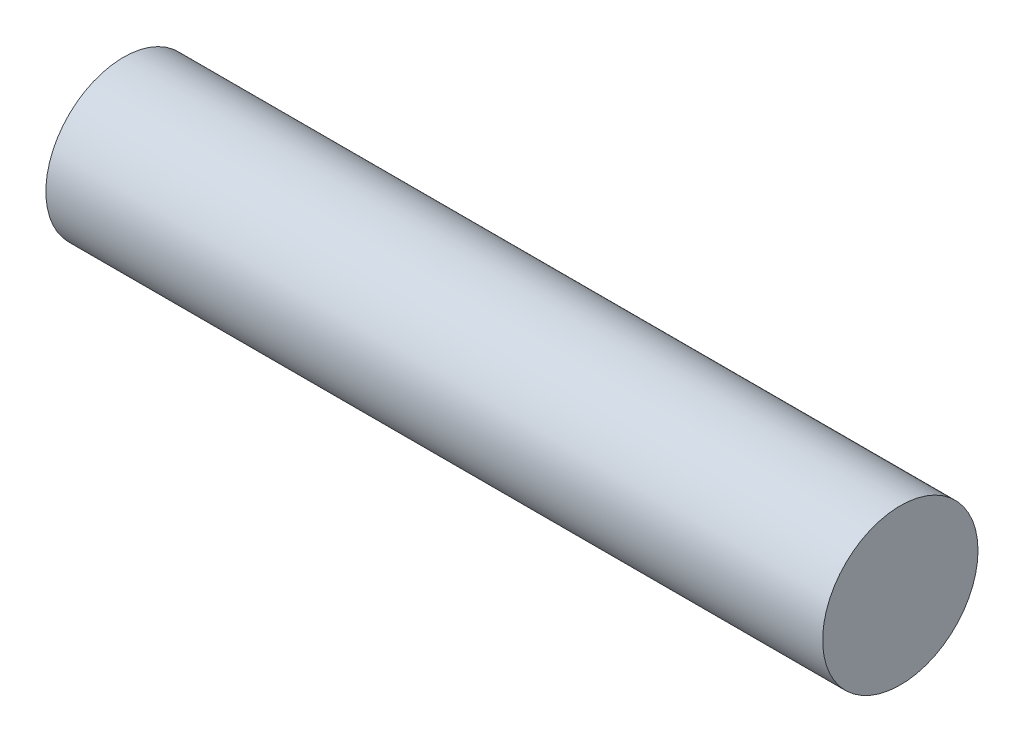
ISO-10303-21;
HEADER;
FILE_DESCRIPTION(('STEP AP214'),'2;1');
FILE_NAME('part.step','',(''),(''),'','','');
FILE_SCHEMA(('AUTOMOTIVE_DESIGN { 1 0 10303 214 1 1 1 1 }'));
ENDSEC;
DATA;
#1=APPLICATION_CONTEXT('core data for automotive mechanical design processes');
#2=APPLICATION_PROTOCOL_DEFINITION('international standard','automotive_design',2000,#1);
#3=PRODUCT_CONTEXT('',#1,'mechanical');
#4=PRODUCT('Part','Part','',(#3));
#5=PRODUCT_RELATED_PRODUCT_CATEGORY('part','',(#4));
#6=PRODUCT_DEFINITION_FORMATION('','',#4);
#7=PRODUCT_DEFINITION_CONTEXT('part definition',#1,'design');
#8=PRODUCT_DEFINITION('design','',#6,#7);
#9=PRODUCT_DEFINITION_SHAPE('','',#8);
#10=(LENGTH_UNIT() NAMED_UNIT(*) SI_UNIT(.MILLI.,.METRE.));
#11=(NAMED_UNIT(*) PLANE_ANGLE_UNIT() SI_UNIT($,.RADIAN.));
#12=(NAMED_UNIT(*) SI_UNIT($,.STERADIAN.) SOLID_ANGLE_UNIT());
#13=UNCERTAINTY_MEASURE_WITH_UNIT(LENGTH_MEASURE(1.E-05),#10,'distance_accuracy_value','');
#14=(GEOMETRIC_REPRESENTATION_CONTEXT(3) GLOBAL_UNCERTAINTY_ASSIGNED_CONTEXT((#13)) GLOBAL_UNIT_ASSIGNED_CONTEXT((#10,
#11,#12)) REPRESENTATION_CONTEXT('',''));
#15=CARTESIAN_POINT('',(0.,0.,0.));
#16=DIRECTION('',(0.,0.,1.));
#17=DIRECTION('',(1.,0.,0.));
#18=AXIS2_PLACEMENT_3D('',#15,#16,#17);
#19=CARTESIAN_POINT('',(7.9375,0.,0.));
#20=DIRECTION('',(-1.,0.,0.));
#21=DIRECTION('',(0.,0.,1.));
#22=AXIS2_PLACEMENT_3D('',#19,#20,#21);
#23=CYLINDRICAL_SURFACE('',#22,1.5875);
#24=CARTESIAN_POINT('',(7.9375,0.,0.));
#25=DIRECTION('',(1.,0.,0.));
#26=DIRECTION('',(0.,0.,-1.));
#27=AXIS2_PLACEMENT_3D('',#24,#25,#26);
#28=CIRCLE('',#27,1.5875);
#29=CARTESIAN_POINT('',(7.9375,0.,-1.5875));
#30=VERTEX_POINT('',#29);
#31=EDGE_CURVE('E10',#30,#30,#28,.T.);
#32=ORIENTED_EDGE('',*,*,#31,.F.);
#33=EDGE_LOOP('',(#32));
#34=FACE_BOUND('',#33,.T.);
#35=CARTESIAN_POINT('',(-7.9375,0.,0.));
#36=DIRECTION('',(1.,0.,0.));
#37=DIRECTION('',(0.,0.,-1.));
#38=AXIS2_PLACEMENT_3D('',#35,#36,#37);
#39=CIRCLE('',#38,1.5875);
#40=CARTESIAN_POINT('',(-7.9375,0.,-1.5875));
#41=VERTEX_POINT('',#40);
#42=EDGE_CURVE('E40',#41,#41,#39,.T.);
#43=ORIENTED_EDGE('',*,*,#42,.T.);
#44=EDGE_LOOP('',(#43));
#45=FACE_BOUND('',#44,.T.);
#46=ADVANCED_FACE('F37',(#34,#45),#23,.T.);
#47=CARTESIAN_POINT('',(7.9375,0.,0.));
#48=DIRECTION('',(1.,0.,0.));
#49=DIRECTION('',(0.,0.,-1.));
#50=AXIS2_PLACEMENT_3D('',#47,#48,#49);
#51=PLANE('',#50);
#52=ORIENTED_EDGE('',*,*,#31,.T.);
#53=EDGE_LOOP('',(#52));
#54=FACE_BOUND('',#53,.T.);
#55=ADVANCED_FACE('F54',(#54),#51,.T.);
#56=CARTESIAN_POINT('',(-7.9375,0.,0.));
#57=DIRECTION('',(1.,0.,0.));
#58=DIRECTION('',(0.,0.,-1.));
#59=AXIS2_PLACEMENT_3D('',#56,#57,#58);
#60=PLANE('',#59);
#61=ORIENTED_EDGE('',*,*,#42,.F.);
#62=EDGE_LOOP('',(#61));
#63=FACE_BOUND('',#62,.T.);
#64=ADVANCED_FACE('F52',(#63),#60,.F.);
#65=CLOSED_SHELL('',(#46,#55,#64));
#66=MANIFOLD_SOLID_BREP('B2',#65);
#67=ADVANCED_BREP_SHAPE_REPRESENTATION('',(#18,#66),#14);
#68=SHAPE_DEFINITION_REPRESENTATION(#9,#67);
ENDSEC;
END-ISO-10303-21;
